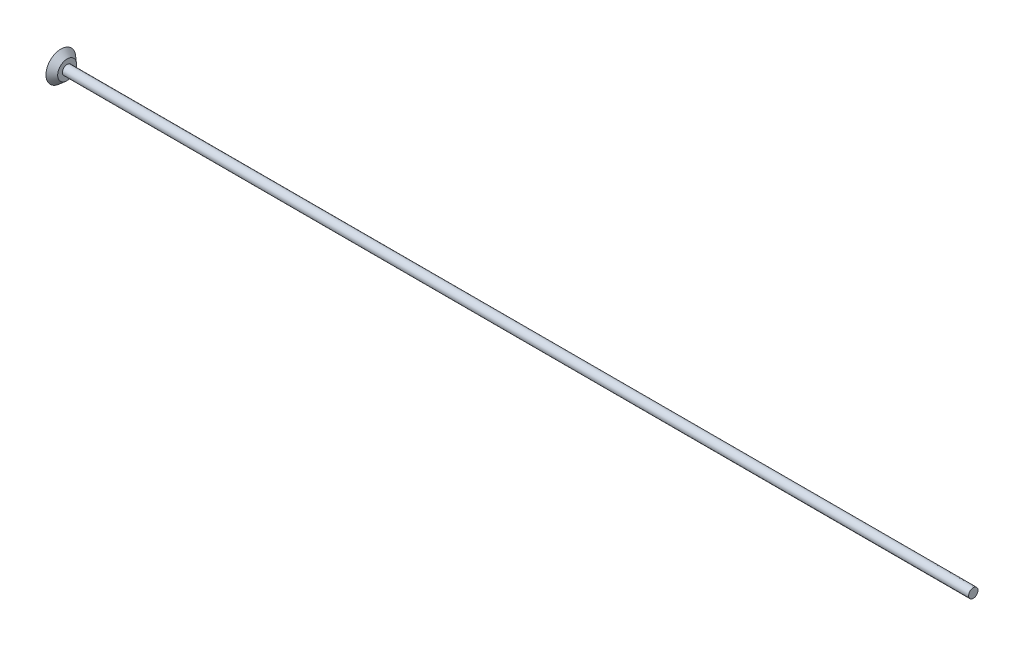
ISO-10303-21;
HEADER;
FILE_DESCRIPTION(('STEP AP214'),'2;1');
FILE_NAME('part.step','',(''),(''),'','','');
FILE_SCHEMA(('AUTOMOTIVE_DESIGN { 1 0 10303 214 1 1 1 1 }'));
ENDSEC;
DATA;
#1=APPLICATION_CONTEXT('core data for automotive mechanical design processes');
#2=APPLICATION_PROTOCOL_DEFINITION('international standard','automotive_design',2000,#1);
#3=PRODUCT_CONTEXT('',#1,'mechanical');
#4=PRODUCT('Part','Part','',(#3));
#5=PRODUCT_RELATED_PRODUCT_CATEGORY('part','',(#4));
#6=PRODUCT_DEFINITION_FORMATION('','',#4);
#7=PRODUCT_DEFINITION_CONTEXT('part definition',#1,'design');
#8=PRODUCT_DEFINITION('design','',#6,#7);
#9=PRODUCT_DEFINITION_SHAPE('','',#8);
#10=(LENGTH_UNIT() NAMED_UNIT(*) SI_UNIT(.MILLI.,.METRE.));
#11=(NAMED_UNIT(*) PLANE_ANGLE_UNIT() SI_UNIT($,.RADIAN.));
#12=(NAMED_UNIT(*) SI_UNIT($,.STERADIAN.) SOLID_ANGLE_UNIT());
#13=UNCERTAINTY_MEASURE_WITH_UNIT(LENGTH_MEASURE(1.E-05),#10,'distance_accuracy_value','');
#14=(GEOMETRIC_REPRESENTATION_CONTEXT(3) GLOBAL_UNCERTAINTY_ASSIGNED_CONTEXT((#13)) GLOBAL_UNIT_ASSIGNED_CONTEXT((#10,
#11,#12)) REPRESENTATION_CONTEXT('',''));
#15=CARTESIAN_POINT('',(0.,0.,0.));
#16=DIRECTION('',(0.,0.,1.));
#17=DIRECTION('',(1.,0.,0.));
#18=AXIS2_PLACEMENT_3D('',#15,#16,#17);
#19=CARTESIAN_POINT('',(0.,0.,0.));
#20=DIRECTION('',(-1.,0.,0.));
#21=DIRECTION('',(0.,0.,1.));
#22=AXIS2_PLACEMENT_3D('',#19,#20,#21);
#23=PLANE('',#22);
#24=CARTESIAN_POINT('',(0.,0.,0.));
#25=DIRECTION('',(1.,0.,0.));
#26=DIRECTION('',(0.,0.,-1.));
#27=AXIS2_PLACEMENT_3D('',#24,#25,#26);
#28=CIRCLE('',#27,4.7625);
#29=CARTESIAN_POINT('',(0.,0.,-4.7625));
#30=VERTEX_POINT('',#29);
#31=EDGE_CURVE('E10',#30,#30,#28,.T.);
#32=ORIENTED_EDGE('',*,*,#31,.F.);
#33=EDGE_LOOP('',(#32));
#34=FACE_BOUND('',#33,.T.);
#35=ADVANCED_FACE('F37',(#34),#23,.T.);
#36=CARTESIAN_POINT('',(2.,0.,0.));
#37=DIRECTION('',(-1.,0.,0.));
#38=DIRECTION('',(0.,0.,1.));
#39=AXIS2_PLACEMENT_3D('',#36,#37,#38);
#40=CONICAL_SURFACE('',#39,3.0136281467128,0.718510435125885);
#41=ORIENTED_EDGE('',*,*,#31,.T.);
#42=EDGE_LOOP('',(#41));
#43=FACE_BOUND('',#42,.T.);
#44=CARTESIAN_POINT('',(2.,0.,0.));
#45=DIRECTION('',(1.,0.,0.));
#46=DIRECTION('',(0.,0.,-1.));
#47=AXIS2_PLACEMENT_3D('',#44,#45,#46);
#48=CIRCLE('',#47,3.0136281467128);
#49=CARTESIAN_POINT('',(2.,0.,-3.0136281467128));
#50=VERTEX_POINT('',#49);
#51=EDGE_CURVE('E44',#50,#50,#48,.T.);
#52=ORIENTED_EDGE('',*,*,#51,.F.);
#53=EDGE_LOOP('',(#52));
#54=FACE_BOUND('',#53,.T.);
#55=ADVANCED_FACE('F73',(#43,#54),#40,.T.);
#56=CARTESIAN_POINT('',(2.,0.,-3.0136281467128));
#57=DIRECTION('',(1.,0.,0.));
#58=DIRECTION('',(0.,0.,-1.));
#59=AXIS2_PLACEMENT_3D('',#56,#57,#58);
#60=PLANE('',#59);
#61=ORIENTED_EDGE('',*,*,#51,.T.);
#62=EDGE_LOOP('',(#61));
#63=FACE_BOUND('',#62,.T.);
#64=CARTESIAN_POINT('',(2.,0.,0.));
#65=DIRECTION('',(1.,0.,0.));
#66=DIRECTION('',(0.,0.,-1.));
#67=AXIS2_PLACEMENT_3D('',#64,#65,#66);
#68=CIRCLE('',#67,1.49999999999999);
#69=CARTESIAN_POINT('',(2.,0.,-1.49999999999999));
#70=VERTEX_POINT('',#69);
#71=EDGE_CURVE('E49',#70,#70,#68,.T.);
#72=ORIENTED_EDGE('',*,*,#71,.F.);
#73=EDGE_LOOP('',(#72));
#74=FACE_BOUND('',#73,.T.);
#75=ADVANCED_FACE('F65',(#63,#74),#60,.T.);
#76=CARTESIAN_POINT('',(292.03068622274,0.,0.));
#77=DIRECTION('',(1.,0.,0.));
#78=DIRECTION('',(0.,0.,-1.));
#79=AXIS2_PLACEMENT_3D('',#76,#77,#78);
#80=CYLINDRICAL_SURFACE('',#79,1.49999999999999);
#81=ORIENTED_EDGE('',*,*,#71,.T.);
#82=EDGE_LOOP('',(#81));
#83=FACE_BOUND('',#82,.T.);
#84=CARTESIAN_POINT('',(292.03068622274,0.,0.));
#85=DIRECTION('',(1.,0.,0.));
#86=DIRECTION('',(0.,0.,-1.));
#87=AXIS2_PLACEMENT_3D('',#84,#85,#86);
#88=CIRCLE('',#87,1.49999999999999);
#89=CARTESIAN_POINT('',(292.03068622274,0.,-1.49999999999999));
#90=VERTEX_POINT('',#89);
#91=EDGE_CURVE('E54',#90,#90,#88,.T.);
#92=ORIENTED_EDGE('',*,*,#91,.F.);
#93=EDGE_LOOP('',(#92));
#94=FACE_BOUND('',#93,.T.);
#95=ADVANCED_FACE('F63',(#83,#94),#80,.T.);
#96=CARTESIAN_POINT('',(292.03068622274,0.,-1.49999999999999));
#97=DIRECTION('',(1.,0.,0.));
#98=DIRECTION('',(0.,0.,-1.));
#99=AXIS2_PLACEMENT_3D('',#96,#97,#98);
#100=PLANE('',#99);
#101=ORIENTED_EDGE('',*,*,#91,.T.);
#102=EDGE_LOOP('',(#101));
#103=FACE_BOUND('',#102,.T.);
#104=ADVANCED_FACE('F61',(#103),#100,.T.);
#105=CLOSED_SHELL('',(#35,#55,#75,#95,#104));
#106=MANIFOLD_SOLID_BREP('B2',#105);
#107=ADVANCED_BREP_SHAPE_REPRESENTATION('',(#18,#106),#14);
#108=SHAPE_DEFINITION_REPRESENTATION(#9,#107);
ENDSEC;
END-ISO-10303-21;
